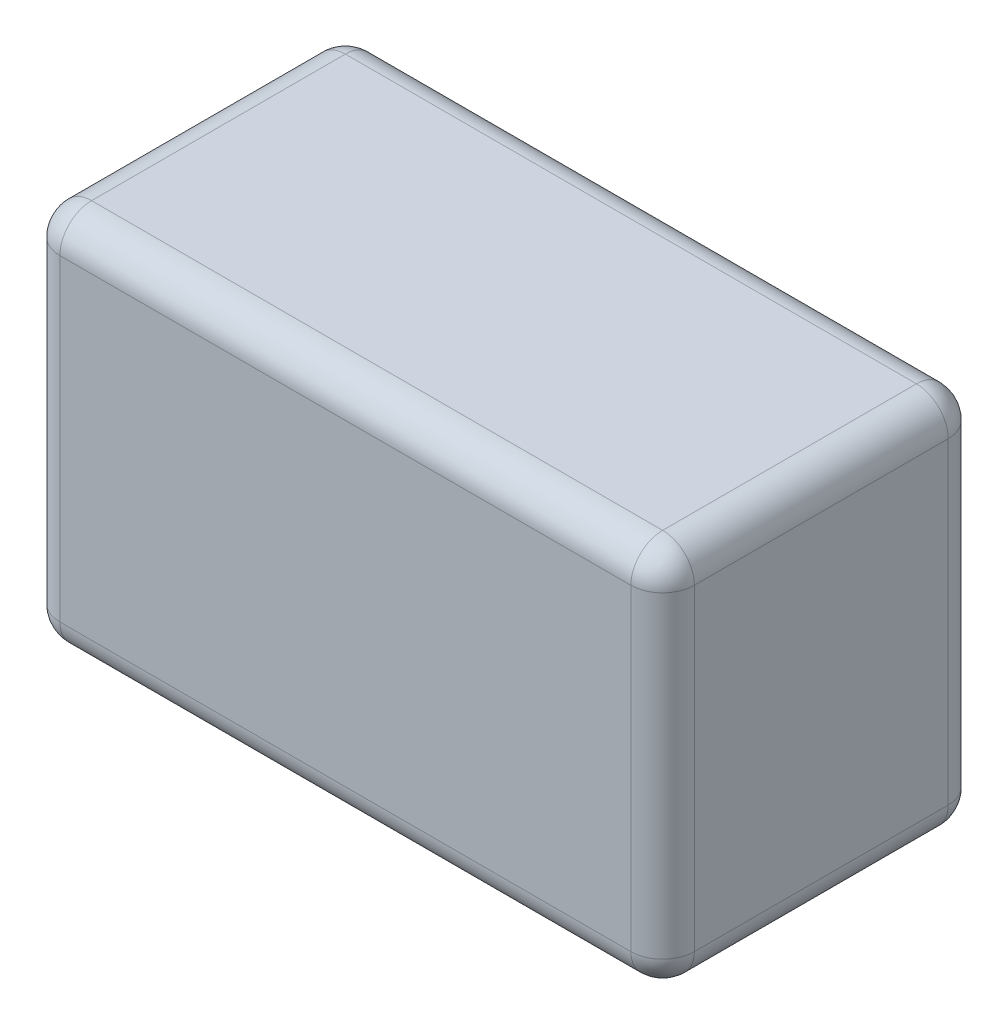
ISO-10303-21;
HEADER;
FILE_DESCRIPTION(('STEP AP214'),'2;1');
FILE_NAME('part.step','',(''),(''),'','','');
FILE_SCHEMA(('AUTOMOTIVE_DESIGN { 1 0 10303 214 1 1 1 1 }'));
ENDSEC;
DATA;
#1=APPLICATION_CONTEXT('core data for automotive mechanical design processes');
#2=APPLICATION_PROTOCOL_DEFINITION('international standard','automotive_design',2000,#1);
#3=PRODUCT_CONTEXT('',#1,'mechanical');
#4=PRODUCT('Part','Part','',(#3));
#5=PRODUCT_RELATED_PRODUCT_CATEGORY('part','',(#4));
#6=PRODUCT_DEFINITION_FORMATION('','',#4);
#7=PRODUCT_DEFINITION_CONTEXT('part definition',#1,'design');
#8=PRODUCT_DEFINITION('design','',#6,#7);
#9=PRODUCT_DEFINITION_SHAPE('','',#8);
#10=(LENGTH_UNIT() NAMED_UNIT(*) SI_UNIT(.MILLI.,.METRE.));
#11=(NAMED_UNIT(*) PLANE_ANGLE_UNIT() SI_UNIT($,.RADIAN.));
#12=(NAMED_UNIT(*) SI_UNIT($,.STERADIAN.) SOLID_ANGLE_UNIT());
#13=UNCERTAINTY_MEASURE_WITH_UNIT(LENGTH_MEASURE(1.E-05),#10,'distance_accuracy_value','');
#14=(GEOMETRIC_REPRESENTATION_CONTEXT(3) GLOBAL_UNCERTAINTY_ASSIGNED_CONTEXT((#13)) GLOBAL_UNIT_ASSIGNED_CONTEXT((#10,
#11,#12)) REPRESENTATION_CONTEXT('',''));
#15=CARTESIAN_POINT('',(0.,0.,0.));
#16=DIRECTION('',(0.,0.,1.));
#17=DIRECTION('',(1.,0.,0.));
#18=AXIS2_PLACEMENT_3D('',#15,#16,#17);
#19=CARTESIAN_POINT('',(0.45,0.05,-0.2));
#20=DIRECTION('',(1.,0.,0.));
#21=DIRECTION('',(0.,-1.,0.));
#22=AXIS2_PLACEMENT_3D('',#19,#20,#21);
#23=SPHERICAL_SURFACE('',#22,0.05);
#24=CARTESIAN_POINT('',(0.45,0.05,-0.2));
#25=DIRECTION('',(1.,0.,0.));
#26=DIRECTION('',(0.,0.,-1.));
#27=AXIS2_PLACEMENT_3D('',#24,#25,#26);
#28=CIRCLE('',#27,0.05);
#29=CARTESIAN_POINT('',(0.45,0.05,-0.25));
#30=VERTEX_POINT('',#29);
#31=CARTESIAN_POINT('',(0.45,0.,-0.2));
#32=VERTEX_POINT('',#31);
#33=EDGE_CURVE('E129',#30,#32,#28,.F.);
#34=ORIENTED_EDGE('',*,*,#33,.F.);
#35=CARTESIAN_POINT('',(0.45,0.05,-0.2));
#36=DIRECTION('',(0.,-1.,0.));
#37=DIRECTION('',(0.,0.,-1.));
#38=AXIS2_PLACEMENT_3D('',#35,#36,#37);
#39=CIRCLE('',#38,0.05);
#40=CARTESIAN_POINT('',(0.5,0.05,-0.2));
#41=VERTEX_POINT('',#40);
#42=EDGE_CURVE('E127',#41,#30,#39,.F.);
#43=ORIENTED_EDGE('',*,*,#42,.F.);
#44=CARTESIAN_POINT('',(0.45,0.05,-0.2));
#45=DIRECTION('',(0.,0.,1.));
#46=DIRECTION('',(1.,0.,0.));
#47=AXIS2_PLACEMENT_3D('',#44,#45,#46);
#48=CIRCLE('',#47,0.05);
#49=EDGE_CURVE('E270',#32,#41,#48,.T.);
#50=ORIENTED_EDGE('',*,*,#49,.F.);
#51=EDGE_LOOP('',(#34,#43,#50));
#52=FACE_BOUND('',#51,.T.);
#53=ADVANCED_FACE('F17',(#52),#23,.T.);
#54=CARTESIAN_POINT('',(-0.45,0.05,-0.2));
#55=DIRECTION('',(1.,0.,0.));
#56=DIRECTION('',(0.,-1.,0.));
#57=AXIS2_PLACEMENT_3D('',#54,#55,#56);
#58=SPHERICAL_SURFACE('',#57,0.05);
#59=CARTESIAN_POINT('',(-0.45,0.05,-0.2));
#60=DIRECTION('',(0.,-1.,0.));
#61=DIRECTION('',(0.,0.,-1.));
#62=AXIS2_PLACEMENT_3D('',#59,#60,#61);
#63=CIRCLE('',#62,0.05);
#64=CARTESIAN_POINT('',(-0.45,0.05,-0.25));
#65=VERTEX_POINT('',#64);
#66=CARTESIAN_POINT('',(-0.5,0.05,-0.2));
#67=VERTEX_POINT('',#66);
#68=EDGE_CURVE('E266',#65,#67,#63,.F.);
#69=ORIENTED_EDGE('',*,*,#68,.F.);
#70=CARTESIAN_POINT('',(-0.45,0.05,-0.2));
#71=DIRECTION('',(1.,0.,0.));
#72=DIRECTION('',(0.,0.,-1.));
#73=AXIS2_PLACEMENT_3D('',#70,#71,#72);
#74=CIRCLE('',#73,0.05);
#75=CARTESIAN_POINT('',(-0.45,0.,-0.2));
#76=VERTEX_POINT('',#75);
#77=EDGE_CURVE('E268',#76,#65,#74,.T.);
#78=ORIENTED_EDGE('',*,*,#77,.F.);
#79=CARTESIAN_POINT('',(-0.45,0.05,-0.2));
#80=DIRECTION('',(0.,0.,-1.));
#81=DIRECTION('',(-1.,0.,0.));
#82=AXIS2_PLACEMENT_3D('',#79,#80,#81);
#83=CIRCLE('',#82,0.05);
#84=EDGE_CURVE('E260',#67,#76,#83,.F.);
#85=ORIENTED_EDGE('',*,*,#84,.F.);
#86=EDGE_LOOP('',(#69,#78,#85));
#87=FACE_BOUND('',#86,.T.);
#88=ADVANCED_FACE('F157',(#87),#58,.T.);
#89=CARTESIAN_POINT('',(-0.45,0.55,-0.2));
#90=DIRECTION('',(1.,0.,0.));
#91=DIRECTION('',(0.,-1.,0.));
#92=AXIS2_PLACEMENT_3D('',#89,#90,#91);
#93=SPHERICAL_SURFACE('',#92,0.05);
#94=CARTESIAN_POINT('',(-0.45,0.55,-0.2));
#95=DIRECTION('',(0.,0.,1.));
#96=DIRECTION('',(1.,0.,0.));
#97=AXIS2_PLACEMENT_3D('',#94,#95,#96);
#98=CIRCLE('',#97,0.05);
#99=CARTESIAN_POINT('',(-0.45,0.6,-0.2));
#100=VERTEX_POINT('',#99);
#101=CARTESIAN_POINT('',(-0.5,0.55,-0.2));
#102=VERTEX_POINT('',#101);
#103=EDGE_CURVE('E257',#100,#102,#98,.T.);
#104=ORIENTED_EDGE('',*,*,#103,.F.);
#105=CARTESIAN_POINT('',(-0.45,0.55,-0.2));
#106=DIRECTION('',(-1.,0.,0.));
#107=DIRECTION('',(0.,0.,1.));
#108=AXIS2_PLACEMENT_3D('',#105,#106,#107);
#109=CIRCLE('',#108,0.05);
#110=CARTESIAN_POINT('',(-0.45,0.55,-0.25));
#111=VERTEX_POINT('',#110);
#112=EDGE_CURVE('E139',#111,#100,#109,.F.);
#113=ORIENTED_EDGE('',*,*,#112,.F.);
#114=CARTESIAN_POINT('',(-0.45,0.55,-0.2));
#115=DIRECTION('',(0.,-1.,0.));
#116=DIRECTION('',(0.,0.,-1.));
#117=AXIS2_PLACEMENT_3D('',#114,#115,#116);
#118=CIRCLE('',#117,0.05);
#119=EDGE_CURVE('E264',#102,#111,#118,.T.);
#120=ORIENTED_EDGE('',*,*,#119,.F.);
#121=EDGE_LOOP('',(#104,#113,#120));
#122=FACE_BOUND('',#121,.T.);
#123=ADVANCED_FACE('F154',(#122),#93,.T.);
#124=CARTESIAN_POINT('',(0.45,0.55,-0.2));
#125=DIRECTION('',(1.,0.,0.));
#126=DIRECTION('',(0.,-1.,0.));
#127=AXIS2_PLACEMENT_3D('',#124,#125,#126);
#128=SPHERICAL_SURFACE('',#127,0.05);
#129=CARTESIAN_POINT('',(0.45,0.55,-0.2));
#130=DIRECTION('',(0.,0.,-1.));
#131=DIRECTION('',(-1.,0.,0.));
#132=AXIS2_PLACEMENT_3D('',#129,#130,#131);
#133=CIRCLE('',#132,0.05);
#134=CARTESIAN_POINT('',(0.5,0.55,-0.2));
#135=VERTEX_POINT('',#134);
#136=CARTESIAN_POINT('',(0.45,0.6,-0.2));
#137=VERTEX_POINT('',#136);
#138=EDGE_CURVE('E142',#135,#137,#133,.F.);
#139=ORIENTED_EDGE('',*,*,#138,.F.);
#140=CARTESIAN_POINT('',(0.45,0.55,-0.2));
#141=DIRECTION('',(0.,-1.,0.));
#142=DIRECTION('',(0.,0.,-1.));
#143=AXIS2_PLACEMENT_3D('',#140,#141,#142);
#144=CIRCLE('',#143,0.05);
#145=CARTESIAN_POINT('',(0.45,0.549999999999952,-0.25));
#146=VERTEX_POINT('',#145);
#147=EDGE_CURVE('E124',#146,#135,#144,.T.);
#148=ORIENTED_EDGE('',*,*,#147,.F.);
#149=CARTESIAN_POINT('',(0.45,0.55,-0.2));
#150=DIRECTION('',(-1.,0.,0.));
#151=DIRECTION('',(0.,0.,1.));
#152=AXIS2_PLACEMENT_3D('',#149,#150,#151);
#153=CIRCLE('',#152,0.05);
#154=EDGE_CURVE('E132',#137,#146,#153,.T.);
#155=ORIENTED_EDGE('',*,*,#154,.F.);
#156=EDGE_LOOP('',(#139,#148,#155));
#157=FACE_BOUND('',#156,.T.);
#158=ADVANCED_FACE('F141',(#157),#128,.T.);
#159=CARTESIAN_POINT('',(0.45,0.6,-0.2));
#160=DIRECTION('',(0.,-1.,0.));
#161=DIRECTION('',(0.,0.,-1.));
#162=AXIS2_PLACEMENT_3D('',#159,#160,#161);
#163=CYLINDRICAL_SURFACE('',#162,0.05);
#164=ORIENTED_EDGE('',*,*,#42,.T.);
#165=DIRECTION('',(0.,-1.,0.));
#166=VECTOR('',#165,1.);
#167=CARTESIAN_POINT('',(0.45,0.6,-0.25));
#168=LINE('',#167,#166);
#169=EDGE_CURVE('E110',#30,#146,#168,.F.);
#170=ORIENTED_EDGE('',*,*,#169,.T.);
#171=ORIENTED_EDGE('',*,*,#147,.T.);
#172=DIRECTION('',(0.,1.,0.));
#173=VECTOR('',#172,1.);
#174=CARTESIAN_POINT('',(0.5,0.6,-0.2));
#175=LINE('',#174,#173);
#176=EDGE_CURVE('E249',#135,#41,#175,.F.);
#177=ORIENTED_EDGE('',*,*,#176,.T.);
#178=EDGE_LOOP('',(#164,#170,#171,#177));
#179=FACE_BOUND('',#178,.T.);
#180=ADVANCED_FACE('F121',(#179),#163,.T.);
#181=CARTESIAN_POINT('',(0.45,0.05,0.25));
#182=DIRECTION('',(0.,0.,1.));
#183=DIRECTION('',(1.,0.,0.));
#184=AXIS2_PLACEMENT_3D('',#181,#182,#183);
#185=CYLINDRICAL_SURFACE('',#184,0.05);
#186=ORIENTED_EDGE('',*,*,#49,.T.);
#187=DIRECTION('',(0.,0.,1.));
#188=VECTOR('',#187,1.);
#189=CARTESIAN_POINT('',(0.5,0.05,0.25));
#190=LINE('',#189,#188);
#191=CARTESIAN_POINT('',(0.5,0.05,0.2));
#192=VERTEX_POINT('',#191);
#193=EDGE_CURVE('E138',#41,#192,#190,.T.);
#194=ORIENTED_EDGE('',*,*,#193,.T.);
#195=CARTESIAN_POINT('',(0.45,0.05,0.2));
#196=DIRECTION('',(0.,0.,-1.));
#197=DIRECTION('',(1.,0.,0.));
#198=AXIS2_PLACEMENT_3D('',#195,#196,#197);
#199=CIRCLE('',#198,0.05);
#200=CARTESIAN_POINT('',(0.45,0.,0.2));
#201=VERTEX_POINT('',#200);
#202=EDGE_CURVE('E243',#201,#192,#199,.F.);
#203=ORIENTED_EDGE('',*,*,#202,.F.);
#204=DIRECTION('',(0.,0.,-1.));
#205=VECTOR('',#204,1.);
#206=CARTESIAN_POINT('',(0.45,0.,-0.25));
#207=LINE('',#206,#205);
#208=EDGE_CURVE('E245',#32,#201,#207,.F.);
#209=ORIENTED_EDGE('',*,*,#208,.F.);
#210=EDGE_LOOP('',(#186,#194,#203,#209));
#211=FACE_BOUND('',#210,.T.);
#212=ADVANCED_FACE('F278',(#211),#185,.T.);
#213=CARTESIAN_POINT('',(-0.45,0.6,-0.2));
#214=DIRECTION('',(0.,-1.,0.));
#215=DIRECTION('',(0.,0.,-1.));
#216=AXIS2_PLACEMENT_3D('',#213,#214,#215);
#217=CYLINDRICAL_SURFACE('',#216,0.05);
#218=ORIENTED_EDGE('',*,*,#119,.T.);
#219=DIRECTION('',(0.,-1.,0.));
#220=VECTOR('',#219,1.);
#221=CARTESIAN_POINT('',(-0.45,0.6,-0.25));
#222=LINE('',#221,#220);
#223=EDGE_CURVE('E112',#111,#65,#222,.T.);
#224=ORIENTED_EDGE('',*,*,#223,.T.);
#225=ORIENTED_EDGE('',*,*,#68,.T.);
#226=DIRECTION('',(0.,1.,0.));
#227=VECTOR('',#226,1.);
#228=CARTESIAN_POINT('',(-0.5,0.6,-0.2));
#229=LINE('',#228,#227);
#230=EDGE_CURVE('E526',#67,#102,#229,.T.);
#231=ORIENTED_EDGE('',*,*,#230,.T.);
#232=EDGE_LOOP('',(#218,#224,#225,#231));
#233=FACE_BOUND('',#232,.T.);
#234=ADVANCED_FACE('F356',(#233),#217,.T.);
#235=CARTESIAN_POINT('',(-0.45,0.05,0.25));
#236=DIRECTION('',(0.,0.,-1.));
#237=DIRECTION('',(-1.,0.,0.));
#238=AXIS2_PLACEMENT_3D('',#235,#236,#237);
#239=CYLINDRICAL_SURFACE('',#238,0.05);
#240=ORIENTED_EDGE('',*,*,#84,.T.);
#241=DIRECTION('',(0.,0.,-1.));
#242=VECTOR('',#241,1.);
#243=CARTESIAN_POINT('',(-0.45,0.,-0.25));
#244=LINE('',#243,#242);
#245=CARTESIAN_POINT('',(-0.45,0.,0.2));
#246=VERTEX_POINT('',#245);
#247=EDGE_CURVE('E241',#246,#76,#244,.T.);
#248=ORIENTED_EDGE('',*,*,#247,.F.);
#249=CARTESIAN_POINT('',(-0.45,0.05,0.2));
#250=DIRECTION('',(0.,0.,-1.));
#251=DIRECTION('',(1.,0.,0.));
#252=AXIS2_PLACEMENT_3D('',#249,#250,#251);
#253=CIRCLE('',#252,0.05);
#254=CARTESIAN_POINT('',(-0.5,0.05,0.2));
#255=VERTEX_POINT('',#254);
#256=EDGE_CURVE('E219',#255,#246,#253,.F.);
#257=ORIENTED_EDGE('',*,*,#256,.F.);
#258=DIRECTION('',(0.,0.,-1.));
#259=VECTOR('',#258,1.);
#260=CARTESIAN_POINT('',(-0.5,0.05,0.25));
#261=LINE('',#260,#259);
#262=EDGE_CURVE('E528',#255,#67,#261,.T.);
#263=ORIENTED_EDGE('',*,*,#262,.T.);
#264=EDGE_LOOP('',(#240,#248,#257,#263));
#265=FACE_BOUND('',#264,.T.);
#266=ADVANCED_FACE('F353',(#265),#239,.T.);
#267=CARTESIAN_POINT('',(0.45,0.55,-0.25));
#268=DIRECTION('',(0.,0.,-1.));
#269=DIRECTION('',(-1.,0.,0.));
#270=AXIS2_PLACEMENT_3D('',#267,#268,#269);
#271=CYLINDRICAL_SURFACE('',#270,0.05);
#272=ORIENTED_EDGE('',*,*,#138,.T.);
#273=DIRECTION('',(0.,0.,-1.));
#274=VECTOR('',#273,1.);
#275=CARTESIAN_POINT('',(0.45,0.6,-0.25));
#276=LINE('',#275,#274);
#277=CARTESIAN_POINT('',(0.45,0.6,0.2));
#278=VERTEX_POINT('',#277);
#279=EDGE_CURVE('E211',#137,#278,#276,.F.);
#280=ORIENTED_EDGE('',*,*,#279,.T.);
#281=CARTESIAN_POINT('',(0.45,0.55,0.2));
#282=DIRECTION('',(0.,0.,1.));
#283=DIRECTION('',(1.,0.,0.));
#284=AXIS2_PLACEMENT_3D('',#281,#282,#283);
#285=CIRCLE('',#284,0.05);
#286=CARTESIAN_POINT('',(0.5,0.55,0.2));
#287=VERTEX_POINT('',#286);
#288=EDGE_CURVE('E213',#287,#278,#285,.T.);
#289=ORIENTED_EDGE('',*,*,#288,.F.);
#290=DIRECTION('',(0.,0.,1.));
#291=VECTOR('',#290,1.);
#292=CARTESIAN_POINT('',(0.5,0.55,0.25));
#293=LINE('',#292,#291);
#294=EDGE_CURVE('E251',#287,#135,#293,.F.);
#295=ORIENTED_EDGE('',*,*,#294,.T.);
#296=EDGE_LOOP('',(#272,#280,#289,#295));
#297=FACE_BOUND('',#296,.T.);
#298=ADVANCED_FACE('F306',(#297),#271,.T.);
#299=CARTESIAN_POINT('',(-0.45,0.55,-0.25));
#300=DIRECTION('',(0.,0.,1.));
#301=DIRECTION('',(1.,0.,0.));
#302=AXIS2_PLACEMENT_3D('',#299,#300,#301);
#303=CYLINDRICAL_SURFACE('',#302,0.05);
#304=ORIENTED_EDGE('',*,*,#103,.T.);
#305=DIRECTION('',(0.,0.,-1.));
#306=VECTOR('',#305,1.);
#307=CARTESIAN_POINT('',(-0.5,0.55,0.25));
#308=LINE('',#307,#306);
#309=CARTESIAN_POINT('',(-0.5,0.55,0.2));
#310=VERTEX_POINT('',#309);
#311=EDGE_CURVE('E521',#102,#310,#308,.F.);
#312=ORIENTED_EDGE('',*,*,#311,.T.);
#313=CARTESIAN_POINT('',(-0.45,0.55,0.2));
#314=DIRECTION('',(0.,0.,1.));
#315=DIRECTION('',(1.,0.,0.));
#316=AXIS2_PLACEMENT_3D('',#313,#314,#315);
#317=CIRCLE('',#316,0.05);
#318=CARTESIAN_POINT('',(-0.45,0.6,0.2));
#319=VERTEX_POINT('',#318);
#320=EDGE_CURVE('E215',#319,#310,#317,.T.);
#321=ORIENTED_EDGE('',*,*,#320,.F.);
#322=DIRECTION('',(0.,0.,-1.));
#323=VECTOR('',#322,1.);
#324=CARTESIAN_POINT('',(-0.45,0.6,-0.25));
#325=LINE('',#324,#323);
#326=EDGE_CURVE('E118',#319,#100,#325,.T.);
#327=ORIENTED_EDGE('',*,*,#326,.T.);
#328=EDGE_LOOP('',(#304,#312,#321,#327));
#329=FACE_BOUND('',#328,.T.);
#330=ADVANCED_FACE('F346',(#329),#303,.T.);
#331=CARTESIAN_POINT('',(-0.5,0.6,-0.25));
#332=DIRECTION('',(0.,0.,1.));
#333=DIRECTION('',(1.,0.,0.));
#334=AXIS2_PLACEMENT_3D('',#331,#332,#333);
#335=PLANE('',#334);
#336=DIRECTION('',(1.,0.,0.));
#337=VECTOR('',#336,1.);
#338=CARTESIAN_POINT('',(-0.5,0.05,-0.25));
#339=LINE('',#338,#337);
#340=EDGE_CURVE('E101',#65,#30,#339,.T.);
#341=ORIENTED_EDGE('',*,*,#340,.F.);
#342=ORIENTED_EDGE('',*,*,#223,.F.);
#343=DIRECTION('',(-1.,0.,0.));
#344=VECTOR('',#343,1.);
#345=CARTESIAN_POINT('',(0.5,0.55,-0.25));
#346=LINE('',#345,#344);
#347=EDGE_CURVE('E107',#146,#111,#346,.T.);
#348=ORIENTED_EDGE('',*,*,#347,.F.);
#349=ORIENTED_EDGE('',*,*,#169,.F.);
#350=EDGE_LOOP('',(#341,#342,#348,#349));
#351=FACE_BOUND('',#350,.T.);
#352=ADVANCED_FACE('F109',(#351),#335,.F.);
#353=CARTESIAN_POINT('',(0.5,0.6,0.25));
#354=DIRECTION('',(-1.,0.,0.));
#355=DIRECTION('',(0.,0.,1.));
#356=AXIS2_PLACEMENT_3D('',#353,#354,#355);
#357=PLANE('',#356);
#358=ORIENTED_EDGE('',*,*,#294,.F.);
#359=DIRECTION('',(0.,-1.,0.));
#360=VECTOR('',#359,1.);
#361=CARTESIAN_POINT('',(0.5,0.6,0.2));
#362=LINE('',#361,#360);
#363=EDGE_CURVE('E285',#192,#287,#362,.F.);
#364=ORIENTED_EDGE('',*,*,#363,.F.);
#365=ORIENTED_EDGE('',*,*,#193,.F.);
#366=ORIENTED_EDGE('',*,*,#176,.F.);
#367=EDGE_LOOP('',(#358,#364,#365,#366));
#368=FACE_BOUND('',#367,.T.);
#369=ADVANCED_FACE('F340',(#368),#357,.F.);
#370=CARTESIAN_POINT('',(-0.5,0.05,-0.2));
#371=DIRECTION('',(1.,0.,0.));
#372=DIRECTION('',(0.,0.,-1.));
#373=AXIS2_PLACEMENT_3D('',#370,#371,#372);
#374=CYLINDRICAL_SURFACE('',#373,0.05);
#375=ORIENTED_EDGE('',*,*,#340,.T.);
#376=ORIENTED_EDGE('',*,*,#33,.T.);
#377=DIRECTION('',(1.,0.,0.));
#378=VECTOR('',#377,1.);
#379=CARTESIAN_POINT('',(0.5,0.,-0.2));
#380=LINE('',#379,#378);
#381=EDGE_CURVE('E273',#76,#32,#380,.T.);
#382=ORIENTED_EDGE('',*,*,#381,.F.);
#383=ORIENTED_EDGE('',*,*,#77,.T.);
#384=EDGE_LOOP('',(#375,#376,#382,#383));
#385=FACE_BOUND('',#384,.T.);
#386=ADVANCED_FACE('F235',(#385),#374,.T.);
#387=CARTESIAN_POINT('',(0.45,0.05,0.2));
#388=DIRECTION('',(1.,0.,0.));
#389=DIRECTION('',(0.,-1.,0.));
#390=AXIS2_PLACEMENT_3D('',#387,#388,#389);
#391=SPHERICAL_SURFACE('',#390,0.05);
#392=CARTESIAN_POINT('',(0.45,0.05,0.2));
#393=DIRECTION('',(-1.,0.,0.));
#394=DIRECTION('',(0.,0.,1.));
#395=AXIS2_PLACEMENT_3D('',#392,#393,#394);
#396=CIRCLE('',#395,0.05);
#397=CARTESIAN_POINT('',(0.45,0.050000000000024,0.25));
#398=VERTEX_POINT('',#397);
#399=EDGE_CURVE('E284',#201,#398,#396,.T.);
#400=ORIENTED_EDGE('',*,*,#399,.F.);
#401=ORIENTED_EDGE('',*,*,#202,.T.);
#402=CARTESIAN_POINT('',(0.45,0.05,0.2));
#403=DIRECTION('',(0.,-1.,0.));
#404=DIRECTION('',(0.,0.,-1.));
#405=AXIS2_PLACEMENT_3D('',#402,#403,#404);
#406=CIRCLE('',#405,0.05);
#407=EDGE_CURVE('E291',#398,#192,#406,.F.);
#408=ORIENTED_EDGE('',*,*,#407,.F.);
#409=EDGE_LOOP('',(#400,#401,#408));
#410=FACE_BOUND('',#409,.T.);
#411=ADVANCED_FACE('F230',(#410),#391,.T.);
#412=CARTESIAN_POINT('',(-0.5,0.6,0.25));
#413=DIRECTION('',(1.,0.,0.));
#414=DIRECTION('',(0.,0.,-1.));
#415=AXIS2_PLACEMENT_3D('',#412,#413,#414);
#416=PLANE('',#415);
#417=ORIENTED_EDGE('',*,*,#311,.F.);
#418=ORIENTED_EDGE('',*,*,#230,.F.);
#419=ORIENTED_EDGE('',*,*,#262,.F.);
#420=DIRECTION('',(0.,-1.,0.));
#421=VECTOR('',#420,1.);
#422=CARTESIAN_POINT('',(-0.5,0.6,0.2));
#423=LINE('',#422,#421);
#424=EDGE_CURVE('E321',#310,#255,#423,.T.);
#425=ORIENTED_EDGE('',*,*,#424,.F.);
#426=EDGE_LOOP('',(#417,#418,#419,#425));
#427=FACE_BOUND('',#426,.T.);
#428=ADVANCED_FACE('F226',(#427),#416,.F.);
#429=CARTESIAN_POINT('',(-0.45,0.05,0.2));
#430=DIRECTION('',(1.,0.,0.));
#431=DIRECTION('',(0.,-1.,0.));
#432=AXIS2_PLACEMENT_3D('',#429,#430,#431);
#433=SPHERICAL_SURFACE('',#432,0.05);
#434=CARTESIAN_POINT('',(-0.45,0.05,0.2));
#435=DIRECTION('',(0.,-1.,0.));
#436=DIRECTION('',(0.,0.,-1.));
#437=AXIS2_PLACEMENT_3D('',#434,#435,#436);
#438=CIRCLE('',#437,0.05);
#439=CARTESIAN_POINT('',(-0.45,0.05,0.25));
#440=VERTEX_POINT('',#439);
#441=EDGE_CURVE('E315',#255,#440,#438,.F.);
#442=ORIENTED_EDGE('',*,*,#441,.F.);
#443=ORIENTED_EDGE('',*,*,#256,.T.);
#444=CARTESIAN_POINT('',(-0.45,0.05,0.2));
#445=DIRECTION('',(-1.,0.,0.));
#446=DIRECTION('',(0.,0.,1.));
#447=AXIS2_PLACEMENT_3D('',#444,#445,#446);
#448=CIRCLE('',#447,0.05);
#449=EDGE_CURVE('E288',#440,#246,#448,.F.);
#450=ORIENTED_EDGE('',*,*,#449,.F.);
#451=EDGE_LOOP('',(#442,#443,#450));
#452=FACE_BOUND('',#451,.T.);
#453=ADVANCED_FACE('F223',(#452),#433,.T.);
#454=CARTESIAN_POINT('',(-0.45,0.55,0.2));
#455=DIRECTION('',(1.,0.,0.));
#456=DIRECTION('',(0.,-1.,0.));
#457=AXIS2_PLACEMENT_3D('',#454,#455,#456);
#458=SPHERICAL_SURFACE('',#457,0.05);
#459=CARTESIAN_POINT('',(-0.45,0.55,0.2));
#460=DIRECTION('',(0.,-1.,0.));
#461=DIRECTION('',(0.,0.,-1.));
#462=AXIS2_PLACEMENT_3D('',#459,#460,#461);
#463=CIRCLE('',#462,0.05);
#464=CARTESIAN_POINT('',(-0.45,0.549999999999808,0.25));
#465=VERTEX_POINT('',#464);
#466=EDGE_CURVE('E324',#465,#310,#463,.T.);
#467=ORIENTED_EDGE('',*,*,#466,.F.);
#468=CARTESIAN_POINT('',(-0.45,0.55,0.2));
#469=DIRECTION('',(1.,0.,0.));
#470=DIRECTION('',(0.,0.,-1.));
#471=AXIS2_PLACEMENT_3D('',#468,#469,#470);
#472=CIRCLE('',#471,0.05);
#473=EDGE_CURVE('E311',#319,#465,#472,.T.);
#474=ORIENTED_EDGE('',*,*,#473,.F.);
#475=ORIENTED_EDGE('',*,*,#320,.T.);
#476=EDGE_LOOP('',(#467,#474,#475));
#477=FACE_BOUND('',#476,.T.);
#478=ADVANCED_FACE('F204',(#477),#458,.T.);
#479=CARTESIAN_POINT('',(0.45,0.55,0.2));
#480=DIRECTION('',(1.,0.,0.));
#481=DIRECTION('',(0.,-1.,0.));
#482=AXIS2_PLACEMENT_3D('',#479,#480,#481);
#483=SPHERICAL_SURFACE('',#482,0.05);
#484=CARTESIAN_POINT('',(0.45,0.55,0.2));
#485=DIRECTION('',(0.,-1.,0.));
#486=DIRECTION('',(0.,0.,-1.));
#487=AXIS2_PLACEMENT_3D('',#484,#485,#486);
#488=CIRCLE('',#487,0.05);
#489=CARTESIAN_POINT('',(0.45,0.55,0.25));
#490=VERTEX_POINT('',#489);
#491=EDGE_CURVE('E117',#287,#490,#488,.T.);
#492=ORIENTED_EDGE('',*,*,#491,.F.);
#493=ORIENTED_EDGE('',*,*,#288,.T.);
#494=CARTESIAN_POINT('',(0.45,0.55,0.2));
#495=DIRECTION('',(1.,0.,0.));
#496=DIRECTION('',(0.,0.,-1.));
#497=AXIS2_PLACEMENT_3D('',#494,#495,#496);
#498=CIRCLE('',#497,0.05);
#499=EDGE_CURVE('E308',#490,#278,#498,.F.);
#500=ORIENTED_EDGE('',*,*,#499,.F.);
#501=EDGE_LOOP('',(#492,#493,#500));
#502=FACE_BOUND('',#501,.T.);
#503=ADVANCED_FACE('F200',(#502),#483,.T.);
#504=CARTESIAN_POINT('',(0.5,0.55,-0.2));
#505=DIRECTION('',(-1.,0.,0.));
#506=DIRECTION('',(0.,0.,1.));
#507=AXIS2_PLACEMENT_3D('',#504,#505,#506);
#508=CYLINDRICAL_SURFACE('',#507,0.05);
#509=DIRECTION('',(1.,0.,0.));
#510=VECTOR('',#509,1.);
#511=CARTESIAN_POINT('',(0.5,0.6,-0.2));
#512=LINE('',#511,#510);
#513=EDGE_CURVE('E134',#100,#137,#512,.T.);
#514=ORIENTED_EDGE('',*,*,#513,.T.);
#515=ORIENTED_EDGE('',*,*,#154,.T.);
#516=ORIENTED_EDGE('',*,*,#347,.T.);
#517=ORIENTED_EDGE('',*,*,#112,.T.);
#518=EDGE_LOOP('',(#514,#515,#516,#517));
#519=FACE_BOUND('',#518,.T.);
#520=ADVANCED_FACE('F133',(#519),#508,.T.);
#521=CARTESIAN_POINT('',(0.45,0.6,0.2));
#522=DIRECTION('',(0.,-1.,0.));
#523=DIRECTION('',(0.,0.,-1.));
#524=AXIS2_PLACEMENT_3D('',#521,#522,#523);
#525=CYLINDRICAL_SURFACE('',#524,0.05);
#526=ORIENTED_EDGE('',*,*,#407,.T.);
#527=ORIENTED_EDGE('',*,*,#363,.T.);
#528=ORIENTED_EDGE('',*,*,#491,.T.);
#529=DIRECTION('',(0.,1.,0.));
#530=VECTOR('',#529,1.);
#531=CARTESIAN_POINT('',(0.45,0.6,0.25));
#532=LINE('',#531,#530);
#533=EDGE_CURVE('E313',#490,#398,#532,.F.);
#534=ORIENTED_EDGE('',*,*,#533,.T.);
#535=EDGE_LOOP('',(#526,#527,#528,#534));
#536=FACE_BOUND('',#535,.T.);
#537=ADVANCED_FACE('F193',(#536),#525,.T.);
#538=CARTESIAN_POINT('',(0.5,0.,-0.25));
#539=DIRECTION('',(0.,-1.,0.));
#540=DIRECTION('',(0.,0.,-1.));
#541=AXIS2_PLACEMENT_3D('',#538,#539,#540);
#542=PLANE('',#541);
#543=ORIENTED_EDGE('',*,*,#381,.T.);
#544=ORIENTED_EDGE('',*,*,#208,.T.);
#545=DIRECTION('',(-1.,0.,0.));
#546=VECTOR('',#545,1.);
#547=CARTESIAN_POINT('',(-0.5,0.,0.2));
#548=LINE('',#547,#546);
#549=EDGE_CURVE('E281',#246,#201,#548,.F.);
#550=ORIENTED_EDGE('',*,*,#549,.F.);
#551=ORIENTED_EDGE('',*,*,#247,.T.);
#552=EDGE_LOOP('',(#543,#544,#550,#551));
#553=FACE_BOUND('',#552,.T.);
#554=ADVANCED_FACE('F189',(#553),#542,.T.);
#555=CARTESIAN_POINT('',(-0.45,0.6,0.2));
#556=DIRECTION('',(0.,-1.,0.));
#557=DIRECTION('',(0.,0.,-1.));
#558=AXIS2_PLACEMENT_3D('',#555,#556,#557);
#559=CYLINDRICAL_SURFACE('',#558,0.05);
#560=ORIENTED_EDGE('',*,*,#441,.T.);
#561=DIRECTION('',(0.,1.,0.));
#562=VECTOR('',#561,1.);
#563=CARTESIAN_POINT('',(-0.45,0.6,0.25));
#564=LINE('',#563,#562);
#565=EDGE_CURVE('E331',#440,#465,#564,.T.);
#566=ORIENTED_EDGE('',*,*,#565,.T.);
#567=ORIENTED_EDGE('',*,*,#466,.T.);
#568=ORIENTED_EDGE('',*,*,#424,.T.);
#569=EDGE_LOOP('',(#560,#566,#567,#568));
#570=FACE_BOUND('',#569,.T.);
#571=ADVANCED_FACE('F185',(#570),#559,.T.);
#572=CARTESIAN_POINT('',(0.5,0.6,-0.25));
#573=DIRECTION('',(0.,-1.,0.));
#574=DIRECTION('',(0.,0.,-1.));
#575=AXIS2_PLACEMENT_3D('',#572,#573,#574);
#576=PLANE('',#575);
#577=ORIENTED_EDGE('',*,*,#513,.F.);
#578=ORIENTED_EDGE('',*,*,#326,.F.);
#579=DIRECTION('',(1.,0.,0.));
#580=VECTOR('',#579,1.);
#581=CARTESIAN_POINT('',(0.5,0.6,0.2));
#582=LINE('',#581,#580);
#583=EDGE_CURVE('E309',#278,#319,#582,.F.);
#584=ORIENTED_EDGE('',*,*,#583,.F.);
#585=ORIENTED_EDGE('',*,*,#279,.F.);
#586=EDGE_LOOP('',(#577,#578,#584,#585));
#587=FACE_BOUND('',#586,.T.);
#588=ADVANCED_FACE('F181',(#587),#576,.F.);
#589=CARTESIAN_POINT('',(-0.5,0.05,0.2));
#590=DIRECTION('',(-1.,0.,0.));
#591=DIRECTION('',(0.,0.,1.));
#592=AXIS2_PLACEMENT_3D('',#589,#590,#591);
#593=CYLINDRICAL_SURFACE('',#592,0.05);
#594=ORIENTED_EDGE('',*,*,#549,.T.);
#595=ORIENTED_EDGE('',*,*,#399,.T.);
#596=DIRECTION('',(-1.,0.,0.));
#597=VECTOR('',#596,1.);
#598=CARTESIAN_POINT('',(-0.5,0.05,0.25));
#599=LINE('',#598,#597);
#600=EDGE_CURVE('E26',#398,#440,#599,.T.);
#601=ORIENTED_EDGE('',*,*,#600,.T.);
#602=ORIENTED_EDGE('',*,*,#449,.T.);
#603=EDGE_LOOP('',(#594,#595,#601,#602));
#604=FACE_BOUND('',#603,.T.);
#605=ADVANCED_FACE('F175',(#604),#593,.T.);
#606=CARTESIAN_POINT('',(0.5,0.55,0.2));
#607=DIRECTION('',(1.,0.,0.));
#608=DIRECTION('',(0.,0.,-1.));
#609=AXIS2_PLACEMENT_3D('',#606,#607,#608);
#610=CYLINDRICAL_SURFACE('',#609,0.05);
#611=DIRECTION('',(-1.,0.,0.));
#612=VECTOR('',#611,1.);
#613=CARTESIAN_POINT('',(-0.5,0.55,0.25));
#614=LINE('',#613,#612);
#615=EDGE_CURVE('E11',#465,#490,#614,.F.);
#616=ORIENTED_EDGE('',*,*,#615,.T.);
#617=ORIENTED_EDGE('',*,*,#499,.T.);
#618=ORIENTED_EDGE('',*,*,#583,.T.);
#619=ORIENTED_EDGE('',*,*,#473,.T.);
#620=EDGE_LOOP('',(#616,#617,#618,#619));
#621=FACE_BOUND('',#620,.T.);
#622=ADVANCED_FACE('F170',(#621),#610,.T.);
#623=CARTESIAN_POINT('',(-0.5,0.6,0.25));
#624=DIRECTION('',(0.,0.,-1.));
#625=DIRECTION('',(-1.,0.,0.));
#626=AXIS2_PLACEMENT_3D('',#623,#624,#625);
#627=PLANE('',#626);
#628=ORIENTED_EDGE('',*,*,#615,.F.);
#629=ORIENTED_EDGE('',*,*,#565,.F.);
#630=ORIENTED_EDGE('',*,*,#600,.F.);
#631=ORIENTED_EDGE('',*,*,#533,.F.);
#632=EDGE_LOOP('',(#628,#629,#630,#631));
#633=FACE_BOUND('',#632,.T.);
#634=ADVANCED_FACE('F168',(#633),#627,.F.);
#635=CLOSED_SHELL('',(#53,#88,#123,#158,#180,#212,#234,#266,#298,#330,#352,#369,#386,#411,#428,
#453,#478,#503,#520,#537,#554,#571,#588,#605,#622,#634));
#636=MANIFOLD_SOLID_BREP('B1',#635);
#637=ADVANCED_BREP_SHAPE_REPRESENTATION('',(#18,#636),#14);
#638=SHAPE_DEFINITION_REPRESENTATION(#9,#637);
ENDSEC;
END-ISO-10303-21;
